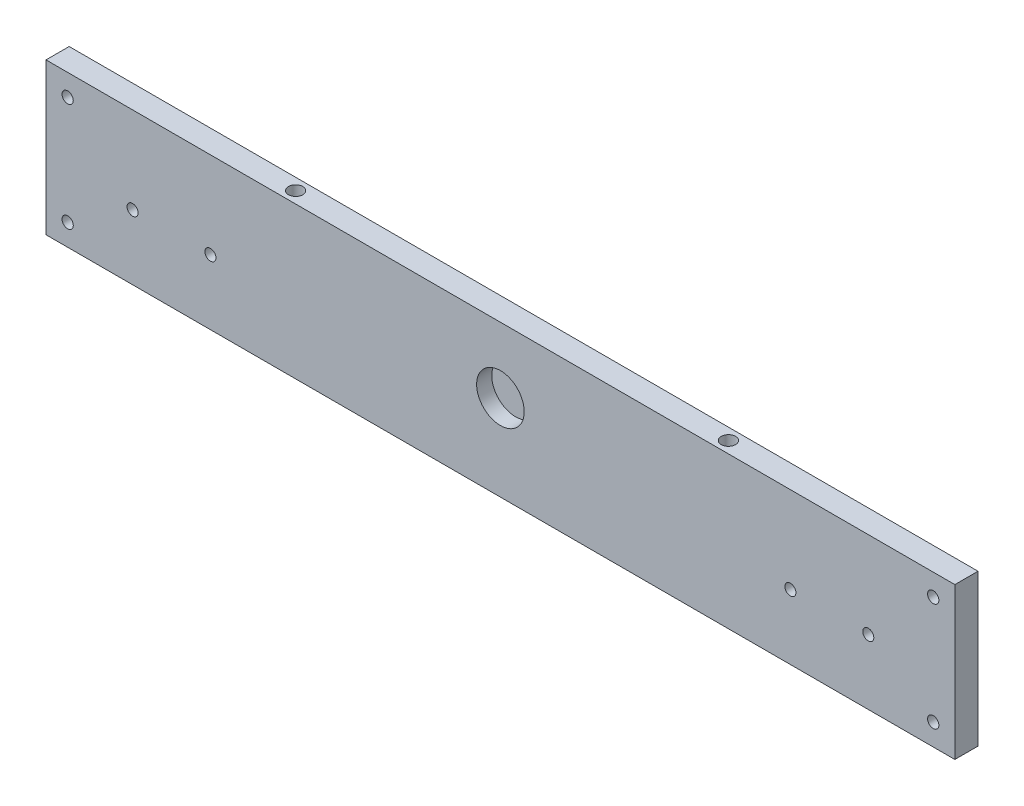
ISO-10303-21;
HEADER;
FILE_DESCRIPTION(('STEP AP214'),'2;1');
FILE_NAME('part.step','',(''),(''),'','','');
FILE_SCHEMA(('AUTOMOTIVE_DESIGN { 1 0 10303 214 1 1 1 1 }'));
ENDSEC;
DATA;
#1=APPLICATION_CONTEXT('core data for automotive mechanical design processes');
#2=APPLICATION_PROTOCOL_DEFINITION('international standard','automotive_design',2000,#1);
#3=PRODUCT_CONTEXT('',#1,'mechanical');
#4=PRODUCT('Part','Part','',(#3));
#5=PRODUCT_RELATED_PRODUCT_CATEGORY('part','',(#4));
#6=PRODUCT_DEFINITION_FORMATION('','',#4);
#7=PRODUCT_DEFINITION_CONTEXT('part definition',#1,'design');
#8=PRODUCT_DEFINITION('design','',#6,#7);
#9=PRODUCT_DEFINITION_SHAPE('','',#8);
#10=(LENGTH_UNIT() NAMED_UNIT(*) SI_UNIT(.MILLI.,.METRE.));
#11=(NAMED_UNIT(*) PLANE_ANGLE_UNIT() SI_UNIT($,.RADIAN.));
#12=(NAMED_UNIT(*) SI_UNIT($,.STERADIAN.) SOLID_ANGLE_UNIT());
#13=UNCERTAINTY_MEASURE_WITH_UNIT(LENGTH_MEASURE(1.E-05),#10,'distance_accuracy_value','');
#14=(GEOMETRIC_REPRESENTATION_CONTEXT(3) GLOBAL_UNCERTAINTY_ASSIGNED_CONTEXT((#13)) GLOBAL_UNIT_ASSIGNED_CONTEXT((#10,
#11,#12)) REPRESENTATION_CONTEXT('',''));
#15=CARTESIAN_POINT('',(0.,0.,0.));
#16=DIRECTION('',(0.,0.,1.));
#17=DIRECTION('',(1.,0.,0.));
#18=AXIS2_PLACEMENT_3D('',#15,#16,#17);
#19=CARTESIAN_POINT('',(-210.,-35.,10.7));
#20=DIRECTION('',(1.,0.,0.));
#21=DIRECTION('',(0.,0.,-1.));
#22=AXIS2_PLACEMENT_3D('',#19,#20,#21);
#23=PLANE('',#22);
#24=DIRECTION('',(0.,-1.,0.));
#25=VECTOR('',#24,1.);
#26=CARTESIAN_POINT('',(-210.,-35.,0.));
#27=LINE('',#26,#25);
#28=CARTESIAN_POINT('',(-210.,35.,0.));
#29=VERTEX_POINT('',#28);
#30=CARTESIAN_POINT('',(-210.,-35.,0.));
#31=VERTEX_POINT('',#30);
#32=EDGE_CURVE('E164',#29,#31,#27,.T.);
#33=ORIENTED_EDGE('',*,*,#32,.T.);
#34=DIRECTION('',(0.,0.,-1.));
#35=VECTOR('',#34,1.);
#36=CARTESIAN_POINT('',(-210.,-35.,10.7));
#37=LINE('',#36,#35);
#38=CARTESIAN_POINT('',(-210.,-35.,10.7));
#39=VERTEX_POINT('',#38);
#40=EDGE_CURVE('E11',#39,#31,#37,.T.);
#41=ORIENTED_EDGE('',*,*,#40,.F.);
#42=DIRECTION('',(0.,-1.,0.));
#43=VECTOR('',#42,1.);
#44=CARTESIAN_POINT('',(-210.,-35.,10.7));
#45=LINE('',#44,#43);
#46=CARTESIAN_POINT('',(-210.,35.,10.7));
#47=VERTEX_POINT('',#46);
#48=EDGE_CURVE('E167',#47,#39,#45,.T.);
#49=ORIENTED_EDGE('',*,*,#48,.F.);
#50=DIRECTION('',(0.,0.,-1.));
#51=VECTOR('',#50,1.);
#52=CARTESIAN_POINT('',(-210.,35.,10.7));
#53=LINE('',#52,#51);
#54=EDGE_CURVE('E173',#47,#29,#53,.T.);
#55=ORIENTED_EDGE('',*,*,#54,.T.);
#56=EDGE_LOOP('',(#33,#41,#49,#55));
#57=FACE_BOUND('',#56,.T.);
#58=ADVANCED_FACE('F37',(#57),#23,.F.);
#59=CARTESIAN_POINT('',(210.,-35.,10.7));
#60=DIRECTION('',(0.,1.,0.));
#61=DIRECTION('',(-1.,0.,0.));
#62=AXIS2_PLACEMENT_3D('',#59,#60,#61);
#63=PLANE('',#62);
#64=DIRECTION('',(1.,0.,0.));
#65=VECTOR('',#64,1.);
#66=CARTESIAN_POINT('',(210.,-35.,0.));
#67=LINE('',#66,#65);
#68=CARTESIAN_POINT('',(210.,-35.,0.));
#69=VERTEX_POINT('',#68);
#70=EDGE_CURVE('E176',#31,#69,#67,.T.);
#71=ORIENTED_EDGE('',*,*,#70,.T.);
#72=DIRECTION('',(0.,0.,-1.));
#73=VECTOR('',#72,1.);
#74=CARTESIAN_POINT('',(210.,-35.,10.7));
#75=LINE('',#74,#73);
#76=CARTESIAN_POINT('',(210.,-35.,10.7));
#77=VERTEX_POINT('',#76);
#78=EDGE_CURVE('E45',#77,#69,#75,.T.);
#79=ORIENTED_EDGE('',*,*,#78,.F.);
#80=DIRECTION('',(1.,0.,0.));
#81=VECTOR('',#80,1.);
#82=CARTESIAN_POINT('',(210.,-35.,10.7));
#83=LINE('',#82,#81);
#84=EDGE_CURVE('E84',#39,#77,#83,.T.);
#85=ORIENTED_EDGE('',*,*,#84,.F.);
#86=ORIENTED_EDGE('',*,*,#40,.T.);
#87=EDGE_LOOP('',(#71,#79,#85,#86));
#88=FACE_BOUND('',#87,.T.);
#89=ADVANCED_FACE('F201',(#88),#63,.F.);
#90=CARTESIAN_POINT('',(210.,-35.,10.7));
#91=DIRECTION('',(-1.,0.,0.));
#92=DIRECTION('',(0.,0.,1.));
#93=AXIS2_PLACEMENT_3D('',#90,#91,#92);
#94=PLANE('',#93);
#95=DIRECTION('',(0.,1.,0.));
#96=VECTOR('',#95,1.);
#97=CARTESIAN_POINT('',(210.,-35.,0.));
#98=LINE('',#97,#96);
#99=CARTESIAN_POINT('',(210.,35.,0.));
#100=VERTEX_POINT('',#99);
#101=EDGE_CURVE('E71',#69,#100,#98,.T.);
#102=ORIENTED_EDGE('',*,*,#101,.T.);
#103=DIRECTION('',(0.,0.,-1.));
#104=VECTOR('',#103,1.);
#105=CARTESIAN_POINT('',(210.,35.,10.7));
#106=LINE('',#105,#104);
#107=CARTESIAN_POINT('',(210.,35.,10.7));
#108=VERTEX_POINT('',#107);
#109=EDGE_CURVE('E181',#108,#100,#106,.T.);
#110=ORIENTED_EDGE('',*,*,#109,.F.);
#111=DIRECTION('',(0.,1.,0.));
#112=VECTOR('',#111,1.);
#113=CARTESIAN_POINT('',(210.,-35.,10.7));
#114=LINE('',#113,#112);
#115=EDGE_CURVE('E170',#77,#108,#114,.T.);
#116=ORIENTED_EDGE('',*,*,#115,.F.);
#117=ORIENTED_EDGE('',*,*,#78,.T.);
#118=EDGE_LOOP('',(#102,#110,#116,#117));
#119=FACE_BOUND('',#118,.T.);
#120=ADVANCED_FACE('F183',(#119),#94,.F.);
#121=CARTESIAN_POINT('',(210.,35.,10.7));
#122=DIRECTION('',(0.,-1.,0.));
#123=DIRECTION('',(1.,0.,0.));
#124=AXIS2_PLACEMENT_3D('',#121,#122,#123);
#125=PLANE('',#124);
#126=CARTESIAN_POINT('',(-100.,35.,5.35));
#127=DIRECTION('',(0.,1.,0.));
#128=DIRECTION('',(0.,0.,1.));
#129=AXIS2_PLACEMENT_3D('',#126,#127,#128);
#130=CIRCLE('',#129,3.31469999999999);
#131=CARTESIAN_POINT('',(-100.,35.,8.66469999999999));
#132=VERTEX_POINT('',#131);
#133=EDGE_CURVE('E102',#132,#132,#130,.T.);
#134=ORIENTED_EDGE('',*,*,#133,.F.);
#135=EDGE_LOOP('',(#134));
#136=FACE_BOUND('',#135,.T.);
#137=CARTESIAN_POINT('',(100.,35.,5.34999999999998));
#138=DIRECTION('',(0.,1.,0.));
#139=DIRECTION('',(0.,0.,1.));
#140=AXIS2_PLACEMENT_3D('',#137,#138,#139);
#141=CIRCLE('',#140,3.31469999999999);
#142=CARTESIAN_POINT('',(100.,35.,8.66469999999997));
#143=VERTEX_POINT('',#142);
#144=EDGE_CURVE('E101',#143,#143,#141,.T.);
#145=ORIENTED_EDGE('',*,*,#144,.F.);
#146=EDGE_LOOP('',(#145));
#147=FACE_BOUND('',#146,.T.);
#148=DIRECTION('',(-1.,0.,0.));
#149=VECTOR('',#148,1.);
#150=CARTESIAN_POINT('',(210.,35.,0.));
#151=LINE('',#150,#149);
#152=EDGE_CURVE('E77',#100,#29,#151,.T.);
#153=ORIENTED_EDGE('',*,*,#152,.T.);
#154=ORIENTED_EDGE('',*,*,#54,.F.);
#155=DIRECTION('',(-1.,0.,0.));
#156=VECTOR('',#155,1.);
#157=CARTESIAN_POINT('',(210.,35.,10.7));
#158=LINE('',#157,#156);
#159=EDGE_CURVE('E53',#108,#47,#158,.T.);
#160=ORIENTED_EDGE('',*,*,#159,.F.);
#161=ORIENTED_EDGE('',*,*,#109,.T.);
#162=EDGE_LOOP('',(#153,#154,#160,#161));
#163=FACE_BOUND('',#162,.T.);
#164=ADVANCED_FACE('F190',(#136,#147,#163),#125,.F.);
#165=CARTESIAN_POINT('',(0.,0.,10.7));
#166=DIRECTION('',(0.,0.,1.));
#167=DIRECTION('',(1.,0.,0.));
#168=AXIS2_PLACEMENT_3D('',#165,#166,#167);
#169=PLANE('',#168);
#170=CARTESIAN_POINT('',(-200.,25.,10.7));
#171=DIRECTION('',(0.,0.,1.));
#172=DIRECTION('',(1.,0.,0.));
#173=AXIS2_PLACEMENT_3D('',#170,#171,#172);
#174=CIRCLE('',#173,2.59999999999999);
#175=CARTESIAN_POINT('',(-197.4,25.,10.7));
#176=VERTEX_POINT('',#175);
#177=EDGE_CURVE('E112',#176,#176,#174,.T.);
#178=ORIENTED_EDGE('',*,*,#177,.F.);
#179=EDGE_LOOP('',(#178));
#180=FACE_BOUND('',#179,.T.);
#181=CARTESIAN_POINT('',(-200.,-25.,10.7));
#182=DIRECTION('',(0.,0.,1.));
#183=DIRECTION('',(1.,0.,0.));
#184=AXIS2_PLACEMENT_3D('',#181,#182,#183);
#185=CIRCLE('',#184,2.59999999999999);
#186=CARTESIAN_POINT('',(-197.4,-25.,10.7));
#187=VERTEX_POINT('',#186);
#188=EDGE_CURVE('E118',#187,#187,#185,.T.);
#189=ORIENTED_EDGE('',*,*,#188,.F.);
#190=EDGE_LOOP('',(#189));
#191=FACE_BOUND('',#190,.T.);
#192=CARTESIAN_POINT('',(200.,-25.,10.7));
#193=DIRECTION('',(0.,0.,1.));
#194=DIRECTION('',(1.,0.,0.));
#195=AXIS2_PLACEMENT_3D('',#192,#193,#194);
#196=CIRCLE('',#195,2.59999999999999);
#197=CARTESIAN_POINT('',(202.6,-25.,10.7));
#198=VERTEX_POINT('',#197);
#199=EDGE_CURVE('E124',#198,#198,#196,.T.);
#200=ORIENTED_EDGE('',*,*,#199,.F.);
#201=EDGE_LOOP('',(#200));
#202=FACE_BOUND('',#201,.T.);
#203=CARTESIAN_POINT('',(200.,25.,10.7));
#204=DIRECTION('',(0.,0.,1.));
#205=DIRECTION('',(1.,0.,0.));
#206=AXIS2_PLACEMENT_3D('',#203,#204,#205);
#207=CIRCLE('',#206,2.59999999999999);
#208=CARTESIAN_POINT('',(202.6,25.,10.7));
#209=VERTEX_POINT('',#208);
#210=EDGE_CURVE('E130',#209,#209,#207,.T.);
#211=ORIENTED_EDGE('',*,*,#210,.F.);
#212=EDGE_LOOP('',(#211));
#213=FACE_BOUND('',#212,.T.);
#214=CARTESIAN_POINT('',(-170.,-5.00000000000003,10.7));
#215=DIRECTION('',(0.,0.,1.));
#216=DIRECTION('',(1.,0.,0.));
#217=AXIS2_PLACEMENT_3D('',#214,#215,#216);
#218=CIRCLE('',#217,2.55269999999999);
#219=CARTESIAN_POINT('',(-167.4473,-5.00000000000003,10.7));
#220=VERTEX_POINT('',#219);
#221=EDGE_CURVE('E136',#220,#220,#218,.T.);
#222=ORIENTED_EDGE('',*,*,#221,.F.);
#223=EDGE_LOOP('',(#222));
#224=FACE_BOUND('',#223,.T.);
#225=CARTESIAN_POINT('',(-134.,-5.00000000000003,10.7));
#226=DIRECTION('',(0.,0.,1.));
#227=DIRECTION('',(1.,0.,0.));
#228=AXIS2_PLACEMENT_3D('',#225,#226,#227);
#229=CIRCLE('',#228,2.55269999999999);
#230=CARTESIAN_POINT('',(-131.4473,-5.00000000000003,10.7));
#231=VERTEX_POINT('',#230);
#232=EDGE_CURVE('E142',#231,#231,#229,.T.);
#233=ORIENTED_EDGE('',*,*,#232,.F.);
#234=EDGE_LOOP('',(#233));
#235=FACE_BOUND('',#234,.T.);
#236=CARTESIAN_POINT('',(134.,-5.,10.7));
#237=DIRECTION('',(0.,0.,1.));
#238=DIRECTION('',(1.,0.,0.));
#239=AXIS2_PLACEMENT_3D('',#236,#237,#238);
#240=CIRCLE('',#239,2.55269999999999);
#241=CARTESIAN_POINT('',(136.5527,-5.,10.7));
#242=VERTEX_POINT('',#241);
#243=EDGE_CURVE('E148',#242,#242,#240,.T.);
#244=ORIENTED_EDGE('',*,*,#243,.F.);
#245=EDGE_LOOP('',(#244));
#246=FACE_BOUND('',#245,.T.);
#247=CARTESIAN_POINT('',(170.,-4.99999999999999,10.7));
#248=DIRECTION('',(0.,0.,1.));
#249=DIRECTION('',(1.,0.,0.));
#250=AXIS2_PLACEMENT_3D('',#247,#248,#249);
#251=CIRCLE('',#250,2.55269999999999);
#252=CARTESIAN_POINT('',(172.5527,-4.99999999999999,10.7));
#253=VERTEX_POINT('',#252);
#254=EDGE_CURVE('E154',#253,#253,#251,.T.);
#255=ORIENTED_EDGE('',*,*,#254,.F.);
#256=EDGE_LOOP('',(#255));
#257=FACE_BOUND('',#256,.T.);
#258=CARTESIAN_POINT('',(0.,4.64999999999997,10.7));
#259=DIRECTION('',(0.,0.,1.));
#260=DIRECTION('',(1.,0.,0.));
#261=AXIS2_PLACEMENT_3D('',#258,#259,#260);
#262=CIRCLE('',#261,11.);
#263=CARTESIAN_POINT('',(11.,4.64999999999997,10.7));
#264=VERTEX_POINT('',#263);
#265=EDGE_CURVE('E160',#264,#264,#262,.T.);
#266=ORIENTED_EDGE('',*,*,#265,.F.);
#267=EDGE_LOOP('',(#266));
#268=FACE_BOUND('',#267,.T.);
#269=ORIENTED_EDGE('',*,*,#48,.T.);
#270=ORIENTED_EDGE('',*,*,#84,.T.);
#271=ORIENTED_EDGE('',*,*,#115,.T.);
#272=ORIENTED_EDGE('',*,*,#159,.T.);
#273=EDGE_LOOP('',(#269,#270,#271,#272));
#274=FACE_BOUND('',#273,.T.);
#275=ADVANCED_FACE('F192',(#180,#191,#202,#213,#224,#235,#246,#257,#268,#274),#169,.T.);
#276=CARTESIAN_POINT('',(0.,0.,0.));
#277=DIRECTION('',(0.,0.,1.));
#278=DIRECTION('',(1.,0.,0.));
#279=AXIS2_PLACEMENT_3D('',#276,#277,#278);
#280=PLANE('',#279);
#281=CARTESIAN_POINT('',(-200.,25.,0.));
#282=DIRECTION('',(0.,0.,1.));
#283=DIRECTION('',(1.,0.,0.));
#284=AXIS2_PLACEMENT_3D('',#281,#282,#283);
#285=CIRCLE('',#284,2.59999999999999);
#286=CARTESIAN_POINT('',(-197.4,25.,0.));
#287=VERTEX_POINT('',#286);
#288=EDGE_CURVE('E115',#287,#287,#285,.T.);
#289=ORIENTED_EDGE('',*,*,#288,.T.);
#290=EDGE_LOOP('',(#289));
#291=FACE_BOUND('',#290,.T.);
#292=CARTESIAN_POINT('',(-200.,-25.,0.));
#293=DIRECTION('',(0.,0.,1.));
#294=DIRECTION('',(1.,0.,0.));
#295=AXIS2_PLACEMENT_3D('',#292,#293,#294);
#296=CIRCLE('',#295,2.59999999999999);
#297=CARTESIAN_POINT('',(-197.4,-25.,0.));
#298=VERTEX_POINT('',#297);
#299=EDGE_CURVE('E121',#298,#298,#296,.T.);
#300=ORIENTED_EDGE('',*,*,#299,.T.);
#301=EDGE_LOOP('',(#300));
#302=FACE_BOUND('',#301,.T.);
#303=CARTESIAN_POINT('',(200.,-25.,0.));
#304=DIRECTION('',(0.,0.,1.));
#305=DIRECTION('',(1.,0.,0.));
#306=AXIS2_PLACEMENT_3D('',#303,#304,#305);
#307=CIRCLE('',#306,2.59999999999999);
#308=CARTESIAN_POINT('',(202.6,-25.,0.));
#309=VERTEX_POINT('',#308);
#310=EDGE_CURVE('E127',#309,#309,#307,.T.);
#311=ORIENTED_EDGE('',*,*,#310,.T.);
#312=EDGE_LOOP('',(#311));
#313=FACE_BOUND('',#312,.T.);
#314=CARTESIAN_POINT('',(200.,25.,0.));
#315=DIRECTION('',(0.,0.,1.));
#316=DIRECTION('',(1.,0.,0.));
#317=AXIS2_PLACEMENT_3D('',#314,#315,#316);
#318=CIRCLE('',#317,2.59999999999999);
#319=CARTESIAN_POINT('',(202.6,25.,0.));
#320=VERTEX_POINT('',#319);
#321=EDGE_CURVE('E133',#320,#320,#318,.T.);
#322=ORIENTED_EDGE('',*,*,#321,.T.);
#323=EDGE_LOOP('',(#322));
#324=FACE_BOUND('',#323,.T.);
#325=CARTESIAN_POINT('',(-170.,-5.00000000000003,0.));
#326=DIRECTION('',(0.,0.,1.));
#327=DIRECTION('',(1.,0.,0.));
#328=AXIS2_PLACEMENT_3D('',#325,#326,#327);
#329=CIRCLE('',#328,2.55269999999999);
#330=CARTESIAN_POINT('',(-167.4473,-5.00000000000003,0.));
#331=VERTEX_POINT('',#330);
#332=EDGE_CURVE('E139',#331,#331,#329,.T.);
#333=ORIENTED_EDGE('',*,*,#332,.T.);
#334=EDGE_LOOP('',(#333));
#335=FACE_BOUND('',#334,.T.);
#336=CARTESIAN_POINT('',(-134.,-5.00000000000003,0.));
#337=DIRECTION('',(0.,0.,1.));
#338=DIRECTION('',(1.,0.,0.));
#339=AXIS2_PLACEMENT_3D('',#336,#337,#338);
#340=CIRCLE('',#339,2.55269999999999);
#341=CARTESIAN_POINT('',(-131.4473,-5.00000000000003,0.));
#342=VERTEX_POINT('',#341);
#343=EDGE_CURVE('E145',#342,#342,#340,.T.);
#344=ORIENTED_EDGE('',*,*,#343,.T.);
#345=EDGE_LOOP('',(#344));
#346=FACE_BOUND('',#345,.T.);
#347=CARTESIAN_POINT('',(134.,-5.,0.));
#348=DIRECTION('',(0.,0.,1.));
#349=DIRECTION('',(1.,0.,0.));
#350=AXIS2_PLACEMENT_3D('',#347,#348,#349);
#351=CIRCLE('',#350,2.55269999999999);
#352=CARTESIAN_POINT('',(136.5527,-5.,0.));
#353=VERTEX_POINT('',#352);
#354=EDGE_CURVE('E151',#353,#353,#351,.T.);
#355=ORIENTED_EDGE('',*,*,#354,.T.);
#356=EDGE_LOOP('',(#355));
#357=FACE_BOUND('',#356,.T.);
#358=CARTESIAN_POINT('',(170.,-4.99999999999999,0.));
#359=DIRECTION('',(0.,0.,1.));
#360=DIRECTION('',(1.,0.,0.));
#361=AXIS2_PLACEMENT_3D('',#358,#359,#360);
#362=CIRCLE('',#361,2.55269999999999);
#363=CARTESIAN_POINT('',(172.5527,-4.99999999999999,0.));
#364=VERTEX_POINT('',#363);
#365=EDGE_CURVE('E157',#364,#364,#362,.T.);
#366=ORIENTED_EDGE('',*,*,#365,.T.);
#367=EDGE_LOOP('',(#366));
#368=FACE_BOUND('',#367,.T.);
#369=ORIENTED_EDGE('',*,*,#32,.F.);
#370=ORIENTED_EDGE('',*,*,#152,.F.);
#371=ORIENTED_EDGE('',*,*,#101,.F.);
#372=ORIENTED_EDGE('',*,*,#70,.F.);
#373=EDGE_LOOP('',(#369,#370,#371,#372));
#374=FACE_BOUND('',#373,.T.);
#375=ADVANCED_FACE('F186',(#291,#302,#313,#324,#335,#346,#357,#368,#374),#280,.F.);
#376=CARTESIAN_POINT('',(0.,4.64999999999997,3.7));
#377=DIRECTION('',(0.,0.,1.));
#378=DIRECTION('',(1.,0.,0.));
#379=AXIS2_PLACEMENT_3D('',#376,#377,#378);
#380=CYLINDRICAL_SURFACE('',#379,11.);
#381=CARTESIAN_POINT('',(0.,4.64999999999997,3.7));
#382=DIRECTION('',(0.,0.,1.));
#383=DIRECTION('',(1.,0.,0.));
#384=AXIS2_PLACEMENT_3D('',#381,#382,#383);
#385=CIRCLE('',#384,11.);
#386=CARTESIAN_POINT('',(11.,4.64999999999997,3.7));
#387=VERTEX_POINT('',#386);
#388=EDGE_CURVE('E161',#387,#387,#385,.T.);
#389=ORIENTED_EDGE('',*,*,#388,.F.);
#390=EDGE_LOOP('',(#389));
#391=FACE_BOUND('',#390,.T.);
#392=ORIENTED_EDGE('',*,*,#265,.T.);
#393=EDGE_LOOP('',(#392));
#394=FACE_BOUND('',#393,.T.);
#395=ADVANCED_FACE('F222',(#391,#394),#380,.F.);
#396=CARTESIAN_POINT('',(0.,4.64999999999997,3.7));
#397=DIRECTION('',(0.,0.,1.));
#398=DIRECTION('',(1.,0.,0.));
#399=AXIS2_PLACEMENT_3D('',#396,#397,#398);
#400=PLANE('',#399);
#401=ORIENTED_EDGE('',*,*,#388,.T.);
#402=EDGE_LOOP('',(#401));
#403=FACE_BOUND('',#402,.T.);
#404=ADVANCED_FACE('F227',(#403),#400,.T.);
#405=CARTESIAN_POINT('',(170.,-4.99999999999999,10.7));
#406=DIRECTION('',(0.,0.,1.));
#407=DIRECTION('',(1.,0.,0.));
#408=AXIS2_PLACEMENT_3D('',#405,#406,#407);
#409=CYLINDRICAL_SURFACE('',#408,2.55269999999999);
#410=ORIENTED_EDGE('',*,*,#365,.F.);
#411=EDGE_LOOP('',(#410));
#412=FACE_BOUND('',#411,.T.);
#413=ORIENTED_EDGE('',*,*,#254,.T.);
#414=EDGE_LOOP('',(#413));
#415=FACE_BOUND('',#414,.T.);
#416=ADVANCED_FACE('F239',(#412,#415),#409,.F.);
#417=CARTESIAN_POINT('',(134.,-5.,10.7));
#418=DIRECTION('',(0.,0.,1.));
#419=DIRECTION('',(1.,0.,0.));
#420=AXIS2_PLACEMENT_3D('',#417,#418,#419);
#421=CYLINDRICAL_SURFACE('',#420,2.55269999999999);
#422=ORIENTED_EDGE('',*,*,#354,.F.);
#423=EDGE_LOOP('',(#422));
#424=FACE_BOUND('',#423,.T.);
#425=ORIENTED_EDGE('',*,*,#243,.T.);
#426=EDGE_LOOP('',(#425));
#427=FACE_BOUND('',#426,.T.);
#428=ADVANCED_FACE('F250',(#424,#427),#421,.F.);
#429=CARTESIAN_POINT('',(-134.,-5.00000000000003,10.7));
#430=DIRECTION('',(0.,0.,1.));
#431=DIRECTION('',(1.,0.,0.));
#432=AXIS2_PLACEMENT_3D('',#429,#430,#431);
#433=CYLINDRICAL_SURFACE('',#432,2.55269999999999);
#434=ORIENTED_EDGE('',*,*,#343,.F.);
#435=EDGE_LOOP('',(#434));
#436=FACE_BOUND('',#435,.T.);
#437=ORIENTED_EDGE('',*,*,#232,.T.);
#438=EDGE_LOOP('',(#437));
#439=FACE_BOUND('',#438,.T.);
#440=ADVANCED_FACE('F264',(#436,#439),#433,.F.);
#441=CARTESIAN_POINT('',(-170.,-5.00000000000003,10.7));
#442=DIRECTION('',(0.,0.,1.));
#443=DIRECTION('',(1.,0.,0.));
#444=AXIS2_PLACEMENT_3D('',#441,#442,#443);
#445=CYLINDRICAL_SURFACE('',#444,2.55269999999999);
#446=ORIENTED_EDGE('',*,*,#332,.F.);
#447=EDGE_LOOP('',(#446));
#448=FACE_BOUND('',#447,.T.);
#449=ORIENTED_EDGE('',*,*,#221,.T.);
#450=EDGE_LOOP('',(#449));
#451=FACE_BOUND('',#450,.T.);
#452=ADVANCED_FACE('F277',(#448,#451),#445,.F.);
#453=CARTESIAN_POINT('',(200.,25.,10.7));
#454=DIRECTION('',(0.,0.,1.));
#455=DIRECTION('',(1.,0.,0.));
#456=AXIS2_PLACEMENT_3D('',#453,#454,#455);
#457=CYLINDRICAL_SURFACE('',#456,2.59999999999999);
#458=ORIENTED_EDGE('',*,*,#321,.F.);
#459=EDGE_LOOP('',(#458));
#460=FACE_BOUND('',#459,.T.);
#461=ORIENTED_EDGE('',*,*,#210,.T.);
#462=EDGE_LOOP('',(#461));
#463=FACE_BOUND('',#462,.T.);
#464=ADVANCED_FACE('F290',(#460,#463),#457,.F.);
#465=CARTESIAN_POINT('',(200.,-25.,10.7));
#466=DIRECTION('',(0.,0.,1.));
#467=DIRECTION('',(1.,0.,0.));
#468=AXIS2_PLACEMENT_3D('',#465,#466,#467);
#469=CYLINDRICAL_SURFACE('',#468,2.59999999999999);
#470=ORIENTED_EDGE('',*,*,#310,.F.);
#471=EDGE_LOOP('',(#470));
#472=FACE_BOUND('',#471,.T.);
#473=ORIENTED_EDGE('',*,*,#199,.T.);
#474=EDGE_LOOP('',(#473));
#475=FACE_BOUND('',#474,.T.);
#476=ADVANCED_FACE('F318',(#472,#475),#469,.F.);
#477=CARTESIAN_POINT('',(-200.,-25.,10.7));
#478=DIRECTION('',(0.,0.,1.));
#479=DIRECTION('',(1.,0.,0.));
#480=AXIS2_PLACEMENT_3D('',#477,#478,#479);
#481=CYLINDRICAL_SURFACE('',#480,2.59999999999999);
#482=ORIENTED_EDGE('',*,*,#299,.F.);
#483=EDGE_LOOP('',(#482));
#484=FACE_BOUND('',#483,.T.);
#485=ORIENTED_EDGE('',*,*,#188,.T.);
#486=EDGE_LOOP('',(#485));
#487=FACE_BOUND('',#486,.T.);
#488=ADVANCED_FACE('F330',(#484,#487),#481,.F.);
#489=CARTESIAN_POINT('',(-200.,25.,10.7));
#490=DIRECTION('',(0.,0.,1.));
#491=DIRECTION('',(1.,0.,0.));
#492=AXIS2_PLACEMENT_3D('',#489,#490,#491);
#493=CYLINDRICAL_SURFACE('',#492,2.59999999999999);
#494=ORIENTED_EDGE('',*,*,#288,.F.);
#495=EDGE_LOOP('',(#494));
#496=FACE_BOUND('',#495,.T.);
#497=ORIENTED_EDGE('',*,*,#177,.T.);
#498=EDGE_LOOP('',(#497));
#499=FACE_BOUND('',#498,.T.);
#500=ADVANCED_FACE('F342',(#496,#499),#493,.F.);
#501=CARTESIAN_POINT('',(100.,20.,5.34999999999998));
#502=DIRECTION('',(0.,1.,0.));
#503=DIRECTION('',(0.,0.,1.));
#504=AXIS2_PLACEMENT_3D('',#501,#502,#503);
#505=CONICAL_SURFACE('',#504,3.3147,1.02974425867665);
#506=CARTESIAN_POINT('',(100.,18.0083273061094,5.34999999999998));
#507=VERTEX_POINT('',#506);
#508=VERTEX_LOOP('',#507);
#509=FACE_BOUND('',#508,.T.);
#510=CARTESIAN_POINT('',(100.,20.,5.34999999999998));
#511=DIRECTION('',(0.,1.,0.));
#512=DIRECTION('',(0.,0.,1.));
#513=AXIS2_PLACEMENT_3D('',#510,#511,#512);
#514=CIRCLE('',#513,3.3147);
#515=CARTESIAN_POINT('',(100.,20.,8.66469999999998));
#516=VERTEX_POINT('',#515);
#517=EDGE_CURVE('E105',#516,#516,#514,.T.);
#518=ORIENTED_EDGE('',*,*,#517,.T.);
#519=EDGE_LOOP('',(#518));
#520=FACE_BOUND('',#519,.T.);
#521=ADVANCED_FACE('F355',(#509,#520),#505,.F.);
#522=CARTESIAN_POINT('',(100.,35.,5.34999999999998));
#523=DIRECTION('',(0.,1.,0.));
#524=DIRECTION('',(0.,0.,1.));
#525=AXIS2_PLACEMENT_3D('',#522,#523,#524);
#526=CYLINDRICAL_SURFACE('',#525,3.3147);
#527=ORIENTED_EDGE('',*,*,#517,.F.);
#528=EDGE_LOOP('',(#527));
#529=FACE_BOUND('',#528,.T.);
#530=ORIENTED_EDGE('',*,*,#144,.T.);
#531=EDGE_LOOP('',(#530));
#532=FACE_BOUND('',#531,.T.);
#533=ADVANCED_FACE('F95',(#529,#532),#526,.F.);
#534=CARTESIAN_POINT('',(-100.,20.,5.35));
#535=DIRECTION('',(0.,1.,0.));
#536=DIRECTION('',(0.,0.,1.));
#537=AXIS2_PLACEMENT_3D('',#534,#535,#536);
#538=CONICAL_SURFACE('',#537,3.3147,1.02974425867665);
#539=CARTESIAN_POINT('',(-100.,18.0083273061093,5.35));
#540=VERTEX_POINT('',#539);
#541=VERTEX_LOOP('',#540);
#542=FACE_BOUND('',#541,.T.);
#543=CARTESIAN_POINT('',(-100.,20.,5.35));
#544=DIRECTION('',(0.,1.,0.));
#545=DIRECTION('',(0.,0.,1.));
#546=AXIS2_PLACEMENT_3D('',#543,#544,#545);
#547=CIRCLE('',#546,3.3147);
#548=CARTESIAN_POINT('',(-100.,20.,8.66470000000001));
#549=VERTEX_POINT('',#548);
#550=EDGE_CURVE('E99',#549,#549,#547,.T.);
#551=ORIENTED_EDGE('',*,*,#550,.T.);
#552=EDGE_LOOP('',(#551));
#553=FACE_BOUND('',#552,.T.);
#554=ADVANCED_FACE('F91',(#542,#553),#538,.F.);
#555=CARTESIAN_POINT('',(-100.,35.,5.35));
#556=DIRECTION('',(0.,1.,0.));
#557=DIRECTION('',(0.,0.,1.));
#558=AXIS2_PLACEMENT_3D('',#555,#556,#557);
#559=CYLINDRICAL_SURFACE('',#558,3.3147);
#560=ORIENTED_EDGE('',*,*,#550,.F.);
#561=EDGE_LOOP('',(#560));
#562=FACE_BOUND('',#561,.T.);
#563=ORIENTED_EDGE('',*,*,#133,.T.);
#564=EDGE_LOOP('',(#563));
#565=FACE_BOUND('',#564,.T.);
#566=ADVANCED_FACE('F94',(#562,#565),#559,.F.);
#567=CLOSED_SHELL('',(#58,#89,#120,#164,#275,#375,#395,#404,#416,#428,#440,#452,#464,#476,#488,
#500,#521,#533,#554,#566));
#568=MANIFOLD_SOLID_BREP('B2',#567);
#569=ADVANCED_BREP_SHAPE_REPRESENTATION('',(#18,#568),#14);
#570=SHAPE_DEFINITION_REPRESENTATION(#9,#569);
ENDSEC;
END-ISO-10303-21;
